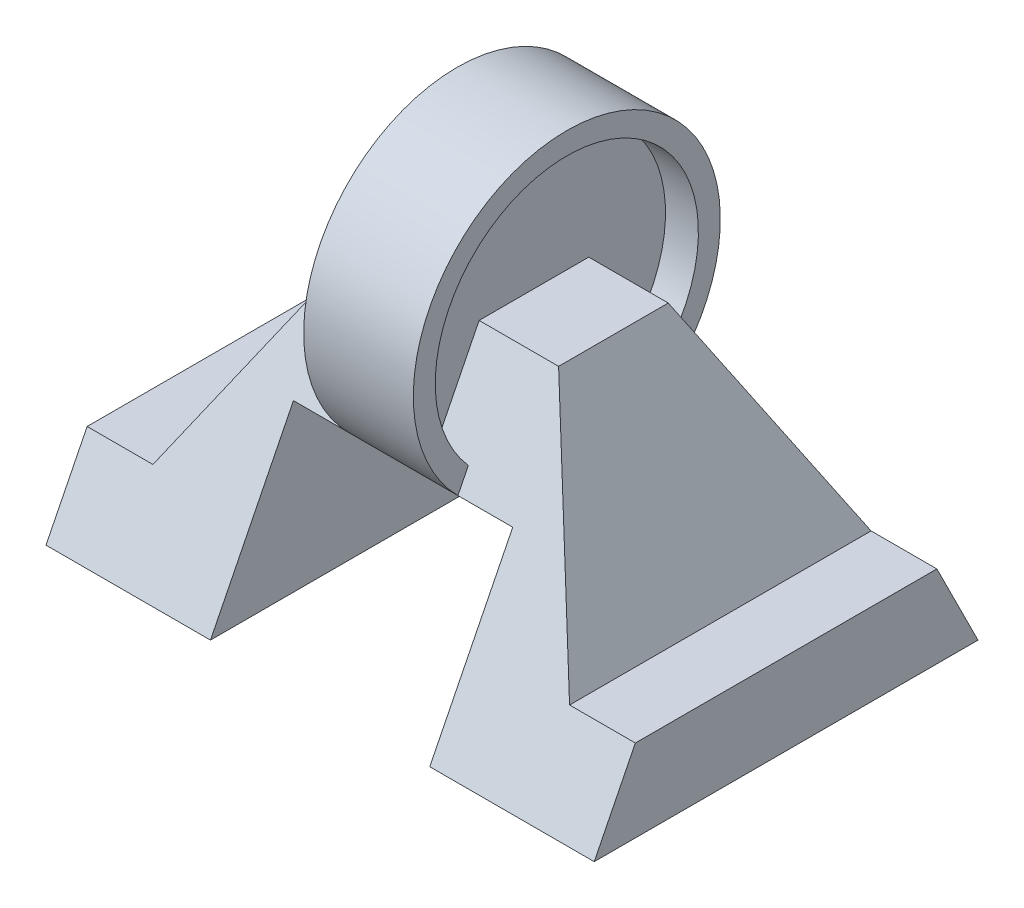
ISO-10303-21;
HEADER;
FILE_DESCRIPTION(('STEP AP214'),'2;1');
FILE_NAME('part.step','',(''),(''),'','','');
FILE_SCHEMA(('AUTOMOTIVE_DESIGN { 1 0 10303 214 1 1 1 1 }'));
ENDSEC;
DATA;
#1=APPLICATION_CONTEXT('core data for automotive mechanical design processes');
#2=APPLICATION_PROTOCOL_DEFINITION('international standard','automotive_design',2000,#1);
#3=PRODUCT_CONTEXT('',#1,'mechanical');
#4=PRODUCT('Part','Part','',(#3));
#5=PRODUCT_RELATED_PRODUCT_CATEGORY('part','',(#4));
#6=PRODUCT_DEFINITION_FORMATION('','',#4);
#7=PRODUCT_DEFINITION_CONTEXT('part definition',#1,'design');
#8=PRODUCT_DEFINITION('design','',#6,#7);
#9=PRODUCT_DEFINITION_SHAPE('','',#8);
#10=(LENGTH_UNIT() NAMED_UNIT(*) SI_UNIT(.MILLI.,.METRE.));
#11=(NAMED_UNIT(*) PLANE_ANGLE_UNIT() SI_UNIT($,.RADIAN.));
#12=(NAMED_UNIT(*) SI_UNIT($,.STERADIAN.) SOLID_ANGLE_UNIT());
#13=UNCERTAINTY_MEASURE_WITH_UNIT(LENGTH_MEASURE(1.E-05),#10,'distance_accuracy_value','');
#14=(GEOMETRIC_REPRESENTATION_CONTEXT(3) GLOBAL_UNCERTAINTY_ASSIGNED_CONTEXT((#13)) GLOBAL_UNIT_ASSIGNED_CONTEXT((#10,
#11,#12)) REPRESENTATION_CONTEXT('',''));
#15=CARTESIAN_POINT('',(0.,0.,0.));
#16=DIRECTION('',(0.,0.,1.));
#17=DIRECTION('',(1.,0.,0.));
#18=AXIS2_PLACEMENT_3D('',#15,#16,#17);
#19=CARTESIAN_POINT('',(50.,14.,-28.));
#20=DIRECTION('',(0.,-0.447213595499958,0.894427190999916));
#21=DIRECTION('',(0.,-0.894427190999916,-0.447213595499958));
#22=AXIS2_PLACEMENT_3D('',#19,#20,#21);
#23=PLANE('',#22);
#24=DIRECTION('',(0.,0.894427190999916,0.447213595499958));
#25=VECTOR('',#24,1.);
#26=CARTESIAN_POINT('',(-20.,14.,-28.));
#27=LINE('',#26,#25);
#28=CARTESIAN_POINT('',(-20.,0.,-35.));
#29=VERTEX_POINT('',#28);
#30=CARTESIAN_POINT('',(-20.,30.2681648412939,-19.8659175793531));
#31=VERTEX_POINT('',#30);
#32=EDGE_CURVE('E359',#29,#31,#27,.T.);
#33=ORIENTED_EDGE('',*,*,#32,.F.);
#34=DIRECTION('',(-1.,0.,0.));
#35=VECTOR('',#34,1.);
#36=CARTESIAN_POINT('',(50.,0.,-35.));
#37=LINE('',#36,#35);
#38=CARTESIAN_POINT('',(-50.,0.,-35.));
#39=VERTEX_POINT('',#38);
#40=EDGE_CURVE('E422',#29,#39,#37,.T.);
#41=ORIENTED_EDGE('',*,*,#40,.T.);
#42=DIRECTION('',(0.,0.894427190999916,0.447213595499958));
#43=VECTOR('',#42,1.);
#44=CARTESIAN_POINT('',(-50.,14.,-28.));
#45=LINE('',#44,#43);
#46=CARTESIAN_POINT('',(-50.,15.,-27.5));
#47=VERTEX_POINT('',#46);
#48=EDGE_CURVE('E414',#39,#47,#45,.T.);
#49=ORIENTED_EDGE('',*,*,#48,.T.);
#50=DIRECTION('',(1.,0.,0.));
#51=VECTOR('',#50,1.);
#52=CARTESIAN_POINT('',(50.,15.,-27.5));
#53=LINE('',#52,#51);
#54=CARTESIAN_POINT('',(-38.,15.,-27.5));
#55=VERTEX_POINT('',#54);
#56=EDGE_CURVE('E154',#47,#55,#53,.T.);
#57=ORIENTED_EDGE('',*,*,#56,.T.);
#58=DIRECTION('',(0.446012941307491,0.800536048500624,0.400268024250312));
#59=VECTOR('',#58,1.);
#60=CARTESIAN_POINT('',(-20.9406879414073,45.6192780538844,-12.1903609730578));
#61=LINE('',#60,#59);
#62=CARTESIAN_POINT('',(-18.5,50.,-10.));
#63=VERTEX_POINT('',#62);
#64=EDGE_CURVE('E361',#55,#63,#61,.T.);
#65=ORIENTED_EDGE('',*,*,#64,.T.);
#66=DIRECTION('',(-1.,0.,0.));
#67=VECTOR('',#66,1.);
#68=CARTESIAN_POINT('',(50.,50.,-10.));
#69=LINE('',#68,#67);
#70=CARTESIAN_POINT('',(-4.,50.,-10.));
#71=VERTEX_POINT('',#70);
#72=EDGE_CURVE('E306',#71,#63,#69,.T.);
#73=ORIENTED_EDGE('',*,*,#72,.F.);
#74=DIRECTION('',(0.,0.894427190999916,0.447213595499958));
#75=VECTOR('',#74,1.);
#76=CARTESIAN_POINT('',(-4.,14.,-28.));
#77=LINE('',#76,#75);
#78=CARTESIAN_POINT('',(-4.,34.080160643218,-17.959919678391));
#79=VERTEX_POINT('',#78);
#80=EDGE_CURVE('E370',#79,#71,#77,.T.);
#81=ORIENTED_EDGE('',*,*,#80,.F.);
#82=DIRECTION('',(-1.,0.,0.));
#83=VECTOR('',#82,1.);
#84=CARTESIAN_POINT('',(10.,34.080160643218,-17.959919678391));
#85=LINE('',#84,#83);
#86=CARTESIAN_POINT('',(-10.,34.080160643218,-17.959919678391));
#87=VERTEX_POINT('',#86);
#88=EDGE_CURVE('E412',#87,#79,#85,.F.);
#89=ORIENTED_EDGE('',*,*,#88,.F.);
#90=DIRECTION('',(0.,0.894427190999916,0.447213595499958));
#91=VECTOR('',#90,1.);
#92=CARTESIAN_POINT('',(-10.,14.,-28.));
#93=LINE('',#92,#91);
#94=CARTESIAN_POINT('',(-10.,30.2681648412939,-19.8659175793531));
#95=VERTEX_POINT('',#94);
#96=EDGE_CURVE('E405',#95,#87,#93,.T.);
#97=ORIENTED_EDGE('',*,*,#96,.F.);
#98=DIRECTION('',(1.,0.,0.));
#99=VECTOR('',#98,1.);
#100=CARTESIAN_POINT('',(50.,30.2681648412939,-19.8659175793531));
#101=LINE('',#100,#99);
#102=EDGE_CURVE('E346',#31,#95,#101,.T.);
#103=ORIENTED_EDGE('',*,*,#102,.F.);
#104=EDGE_LOOP('',(#33,#41,#49,#57,#65,#73,#81,#89,#97,#103));
#105=FACE_BOUND('',#104,.T.);
#106=ADVANCED_FACE('F132',(#105),#23,.F.);
#107=CARTESIAN_POINT('',(10.,30.2681648412939,-19.8659175793531));
#108=VERTEX_POINT('',#107);
#109=CARTESIAN_POINT('',(20.,30.2681648412939,-19.8659175793531));
#110=VERTEX_POINT('',#109);
#111=EDGE_CURVE('E342',#108,#110,#101,.T.);
#112=ORIENTED_EDGE('',*,*,#111,.F.);
#113=DIRECTION('',(0.,0.894427190999916,0.447213595499958));
#114=VECTOR('',#113,1.);
#115=CARTESIAN_POINT('',(10.,14.,-28.));
#116=LINE('',#115,#114);
#117=CARTESIAN_POINT('',(10.,34.080160643218,-17.959919678391));
#118=VERTEX_POINT('',#117);
#119=EDGE_CURVE('E408',#108,#118,#116,.T.);
#120=ORIENTED_EDGE('',*,*,#119,.T.);
#121=CARTESIAN_POINT('',(4.,34.080160643218,-17.959919678391));
#122=VERTEX_POINT('',#121);
#123=EDGE_CURVE('E411',#122,#118,#85,.F.);
#124=ORIENTED_EDGE('',*,*,#123,.F.);
#125=DIRECTION('',(0.,0.894427190999916,0.447213595499958));
#126=VECTOR('',#125,1.);
#127=CARTESIAN_POINT('',(4.,14.,-28.));
#128=LINE('',#127,#126);
#129=CARTESIAN_POINT('',(4.,50.,-10.));
#130=VERTEX_POINT('',#129);
#131=EDGE_CURVE('E376',#122,#130,#128,.T.);
#132=ORIENTED_EDGE('',*,*,#131,.T.);
#133=CARTESIAN_POINT('',(18.5,50.,-10.));
#134=VERTEX_POINT('',#133);
#135=EDGE_CURVE('E307',#134,#130,#69,.T.);
#136=ORIENTED_EDGE('',*,*,#135,.F.);
#137=DIRECTION('',(-0.446012941307491,0.800536048500624,0.400268024250312));
#138=VECTOR('',#137,1.);
#139=CARTESIAN_POINT('',(40.8334423227832,9.91433429244049,-30.0428328537798));
#140=LINE('',#139,#138);
#141=CARTESIAN_POINT('',(38.,15.,-27.5));
#142=VERTEX_POINT('',#141);
#143=EDGE_CURVE('E363',#142,#134,#140,.T.);
#144=ORIENTED_EDGE('',*,*,#143,.F.);
#145=DIRECTION('',(-1.,0.,0.));
#146=VECTOR('',#145,1.);
#147=CARTESIAN_POINT('',(50.,15.,-27.5));
#148=LINE('',#147,#146);
#149=CARTESIAN_POINT('',(50.,15.,-27.5));
#150=VERTEX_POINT('',#149);
#151=EDGE_CURVE('E292',#150,#142,#148,.T.);
#152=ORIENTED_EDGE('',*,*,#151,.F.);
#153=DIRECTION('',(0.,0.894427190999916,0.447213595499958));
#154=VECTOR('',#153,1.);
#155=CARTESIAN_POINT('',(50.,14.,-28.));
#156=LINE('',#155,#154);
#157=CARTESIAN_POINT('',(50.,0.,-35.));
#158=VERTEX_POINT('',#157);
#159=EDGE_CURVE('E415',#158,#150,#156,.T.);
#160=ORIENTED_EDGE('',*,*,#159,.F.);
#161=CARTESIAN_POINT('',(20.,0.,-35.));
#162=VERTEX_POINT('',#161);
#163=EDGE_CURVE('E302',#158,#162,#37,.T.);
#164=ORIENTED_EDGE('',*,*,#163,.T.);
#165=DIRECTION('',(0.,0.894427190999916,0.447213595499958));
#166=VECTOR('',#165,1.);
#167=CARTESIAN_POINT('',(20.,14.,-28.));
#168=LINE('',#167,#166);
#169=EDGE_CURVE('E275',#162,#110,#168,.T.);
#170=ORIENTED_EDGE('',*,*,#169,.T.);
#171=EDGE_LOOP('',(#112,#120,#124,#132,#136,#144,#152,#160,#164,#170));
#172=FACE_BOUND('',#171,.T.);
#173=ADVANCED_FACE('F442',(#172),#23,.F.);
#174=CARTESIAN_POINT('',(50.,50.,0.));
#175=DIRECTION('',(0.,-1.,0.));
#176=DIRECTION('',(0.,0.,-1.));
#177=AXIS2_PLACEMENT_3D('',#174,#175,#176);
#178=PLANE('',#177);
#179=DIRECTION('',(0.,0.,1.));
#180=VECTOR('',#179,1.);
#181=CARTESIAN_POINT('',(18.5,50.,-35.));
#182=LINE('',#181,#180);
#183=CARTESIAN_POINT('',(18.5,50.,9.99999999999999));
#184=VERTEX_POINT('',#183);
#185=EDGE_CURVE('E455',#134,#184,#182,.T.);
#186=ORIENTED_EDGE('',*,*,#185,.F.);
#187=ORIENTED_EDGE('',*,*,#135,.T.);
#188=DIRECTION('',(0.,0.,1.));
#189=VECTOR('',#188,1.);
#190=CARTESIAN_POINT('',(4.,50.,0.));
#191=LINE('',#190,#189);
#192=CARTESIAN_POINT('',(4.,50.,10.));
#193=VERTEX_POINT('',#192);
#194=EDGE_CURVE('E373',#130,#193,#191,.T.);
#195=ORIENTED_EDGE('',*,*,#194,.T.);
#196=DIRECTION('',(-1.,0.,0.));
#197=VECTOR('',#196,1.);
#198=CARTESIAN_POINT('',(50.,50.,10.));
#199=LINE('',#198,#197);
#200=EDGE_CURVE('E300',#184,#193,#199,.T.);
#201=ORIENTED_EDGE('',*,*,#200,.F.);
#202=EDGE_LOOP('',(#186,#187,#195,#201));
#203=FACE_BOUND('',#202,.T.);
#204=ADVANCED_FACE('F454',(#203),#178,.F.);
#205=CARTESIAN_POINT('',(50.,14.,28.));
#206=DIRECTION('',(0.,-0.447213595499958,-0.894427190999916));
#207=DIRECTION('',(0.,0.894427190999916,-0.447213595499958));
#208=AXIS2_PLACEMENT_3D('',#205,#206,#207);
#209=PLANE('',#208);
#210=DIRECTION('',(0.,-0.894427190999916,0.447213595499958));
#211=VECTOR('',#210,1.);
#212=CARTESIAN_POINT('',(-20.,14.,28.));
#213=LINE('',#212,#211);
#214=CARTESIAN_POINT('',(-20.,30.2681648412939,19.865917579353));
#215=VERTEX_POINT('',#214);
#216=CARTESIAN_POINT('',(-20.,0.,35.));
#217=VERTEX_POINT('',#216);
#218=EDGE_CURVE('E357',#215,#217,#213,.T.);
#219=ORIENTED_EDGE('',*,*,#218,.F.);
#220=DIRECTION('',(-1.,0.,0.));
#221=VECTOR('',#220,1.);
#222=CARTESIAN_POINT('',(50.,30.2681648412939,19.8659175793531));
#223=LINE('',#222,#221);
#224=CARTESIAN_POINT('',(-10.,30.2681648412939,19.8659175793531));
#225=VERTEX_POINT('',#224);
#226=EDGE_CURVE('E344',#225,#215,#223,.T.);
#227=ORIENTED_EDGE('',*,*,#226,.F.);
#228=DIRECTION('',(0.,-0.894427190999916,0.447213595499958));
#229=VECTOR('',#228,1.);
#230=CARTESIAN_POINT('',(-10.,14.,28.));
#231=LINE('',#230,#229);
#232=CARTESIAN_POINT('',(-10.,34.080160643218,17.959919678391));
#233=VERTEX_POINT('',#232);
#234=EDGE_CURVE('E309',#233,#225,#231,.T.);
#235=ORIENTED_EDGE('',*,*,#234,.F.);
#236=DIRECTION('',(-1.,0.,0.));
#237=VECTOR('',#236,1.);
#238=CARTESIAN_POINT('',(10.,34.080160643218,17.959919678391));
#239=LINE('',#238,#237);
#240=CARTESIAN_POINT('',(-4.,34.080160643218,17.959919678391));
#241=VERTEX_POINT('',#240);
#242=EDGE_CURVE('E312',#241,#233,#239,.T.);
#243=ORIENTED_EDGE('',*,*,#242,.F.);
#244=DIRECTION('',(0.,-0.894427190999916,0.447213595499958));
#245=VECTOR('',#244,1.);
#246=CARTESIAN_POINT('',(-4.,14.,28.));
#247=LINE('',#246,#245);
#248=CARTESIAN_POINT('',(-4.,50.,10.));
#249=VERTEX_POINT('',#248);
#250=EDGE_CURVE('E382',#249,#241,#247,.T.);
#251=ORIENTED_EDGE('',*,*,#250,.F.);
#252=CARTESIAN_POINT('',(-18.5,50.,10.));
#253=VERTEX_POINT('',#252);
#254=EDGE_CURVE('E296',#249,#253,#199,.T.);
#255=ORIENTED_EDGE('',*,*,#254,.T.);
#256=DIRECTION('',(-0.446012941307491,-0.800536048500624,0.400268024250312));
#257=VECTOR('',#256,1.);
#258=CARTESIAN_POINT('',(-20.9406879414073,45.6192780538844,12.1903609730578));
#259=LINE('',#258,#257);
#260=CARTESIAN_POINT('',(-38.,15.,27.5));
#261=VERTEX_POINT('',#260);
#262=EDGE_CURVE('E139',#253,#261,#259,.T.);
#263=ORIENTED_EDGE('',*,*,#262,.T.);
#264=DIRECTION('',(-1.,0.,0.));
#265=VECTOR('',#264,1.);
#266=CARTESIAN_POINT('',(50.,15.,27.5));
#267=LINE('',#266,#265);
#268=CARTESIAN_POINT('',(-50.,15.,27.5));
#269=VERTEX_POINT('',#268);
#270=EDGE_CURVE('E327',#261,#269,#267,.T.);
#271=ORIENTED_EDGE('',*,*,#270,.T.);
#272=DIRECTION('',(0.,-0.894427190999916,0.447213595499958));
#273=VECTOR('',#272,1.);
#274=CARTESIAN_POINT('',(-50.,14.,28.));
#275=LINE('',#274,#273);
#276=CARTESIAN_POINT('',(-50.,0.,35.));
#277=VERTEX_POINT('',#276);
#278=EDGE_CURVE('E425',#269,#277,#275,.T.);
#279=ORIENTED_EDGE('',*,*,#278,.T.);
#280=DIRECTION('',(-1.,0.,0.));
#281=VECTOR('',#280,1.);
#282=CARTESIAN_POINT('',(50.,0.,35.));
#283=LINE('',#282,#281);
#284=EDGE_CURVE('E297',#217,#277,#283,.T.);
#285=ORIENTED_EDGE('',*,*,#284,.F.);
#286=EDGE_LOOP('',(#219,#227,#235,#243,#251,#255,#263,#271,#279,#285));
#287=FACE_BOUND('',#286,.T.);
#288=ADVANCED_FACE('F325',(#287),#209,.F.);
#289=CARTESIAN_POINT('',(20.,30.2681648412939,19.865917579353));
#290=VERTEX_POINT('',#289);
#291=CARTESIAN_POINT('',(10.,30.2681648412939,19.8659175793531));
#292=VERTEX_POINT('',#291);
#293=EDGE_CURVE('E291',#290,#292,#223,.T.);
#294=ORIENTED_EDGE('',*,*,#293,.F.);
#295=DIRECTION('',(0.,-0.894427190999916,0.447213595499958));
#296=VECTOR('',#295,1.);
#297=CARTESIAN_POINT('',(20.,14.,28.));
#298=LINE('',#297,#296);
#299=CARTESIAN_POINT('',(20.,0.,35.));
#300=VERTEX_POINT('',#299);
#301=EDGE_CURVE('E272',#290,#300,#298,.T.);
#302=ORIENTED_EDGE('',*,*,#301,.T.);
#303=CARTESIAN_POINT('',(50.,0.,35.));
#304=VERTEX_POINT('',#303);
#305=EDGE_CURVE('E288',#304,#300,#283,.T.);
#306=ORIENTED_EDGE('',*,*,#305,.F.);
#307=DIRECTION('',(0.,-0.894427190999916,0.447213595499958));
#308=VECTOR('',#307,1.);
#309=CARTESIAN_POINT('',(50.,14.,28.));
#310=LINE('',#309,#308);
#311=CARTESIAN_POINT('',(50.,15.,27.5));
#312=VERTEX_POINT('',#311);
#313=EDGE_CURVE('E418',#312,#304,#310,.T.);
#314=ORIENTED_EDGE('',*,*,#313,.F.);
#315=DIRECTION('',(1.,0.,0.));
#316=VECTOR('',#315,1.);
#317=CARTESIAN_POINT('',(50.,15.,27.5));
#318=LINE('',#317,#316);
#319=CARTESIAN_POINT('',(38.,15.,27.5));
#320=VERTEX_POINT('',#319);
#321=EDGE_CURVE('E146',#320,#312,#318,.T.);
#322=ORIENTED_EDGE('',*,*,#321,.F.);
#323=DIRECTION('',(0.446012941307491,-0.800536048500624,0.400268024250312));
#324=VECTOR('',#323,1.);
#325=CARTESIAN_POINT('',(40.8334423227832,9.91433429244049,30.0428328537797));
#326=LINE('',#325,#324);
#327=EDGE_CURVE('E12',#184,#320,#326,.T.);
#328=ORIENTED_EDGE('',*,*,#327,.F.);
#329=ORIENTED_EDGE('',*,*,#200,.T.);
#330=DIRECTION('',(0.,-0.894427190999916,0.447213595499958));
#331=VECTOR('',#330,1.);
#332=CARTESIAN_POINT('',(4.,14.,28.));
#333=LINE('',#332,#331);
#334=CARTESIAN_POINT('',(4.,34.080160643218,17.959919678391));
#335=VERTEX_POINT('',#334);
#336=EDGE_CURVE('E369',#193,#335,#333,.T.);
#337=ORIENTED_EDGE('',*,*,#336,.T.);
#338=CARTESIAN_POINT('',(10.,34.080160643218,17.959919678391));
#339=VERTEX_POINT('',#338);
#340=EDGE_CURVE('E313',#339,#335,#239,.T.);
#341=ORIENTED_EDGE('',*,*,#340,.F.);
#342=DIRECTION('',(0.,-0.894427190999916,0.447213595499958));
#343=VECTOR('',#342,1.);
#344=CARTESIAN_POINT('',(10.,14.,28.));
#345=LINE('',#344,#343);
#346=EDGE_CURVE('E316',#339,#292,#345,.T.);
#347=ORIENTED_EDGE('',*,*,#346,.T.);
#348=EDGE_LOOP('',(#294,#302,#306,#314,#322,#328,#329,#337,#341,#347));
#349=FACE_BOUND('',#348,.T.);
#350=ADVANCED_FACE('F286',(#349),#209,.F.);
#351=CARTESIAN_POINT('',(50.,0.,0.));
#352=DIRECTION('',(0.,1.,0.));
#353=DIRECTION('',(0.,0.,1.));
#354=AXIS2_PLACEMENT_3D('',#351,#352,#353);
#355=PLANE('',#354);
#356=DIRECTION('',(0.,0.,1.));
#357=VECTOR('',#356,1.);
#358=CARTESIAN_POINT('',(-20.,0.,-35.));
#359=LINE('',#358,#357);
#360=EDGE_CURVE('E347',#29,#217,#359,.T.);
#361=ORIENTED_EDGE('',*,*,#360,.T.);
#362=ORIENTED_EDGE('',*,*,#284,.T.);
#363=DIRECTION('',(0.,0.,-1.));
#364=VECTOR('',#363,1.);
#365=CARTESIAN_POINT('',(-50.,0.,0.));
#366=LINE('',#365,#364);
#367=EDGE_CURVE('E419',#277,#39,#366,.T.);
#368=ORIENTED_EDGE('',*,*,#367,.T.);
#369=ORIENTED_EDGE('',*,*,#40,.F.);
#370=EDGE_LOOP('',(#361,#362,#368,#369));
#371=FACE_BOUND('',#370,.T.);
#372=ADVANCED_FACE('F432',(#371),#355,.F.);
#373=CARTESIAN_POINT('',(50.,0.,0.));
#374=DIRECTION('',(1.,0.,0.));
#375=DIRECTION('',(0.,0.,-1.));
#376=AXIS2_PLACEMENT_3D('',#373,#374,#375);
#377=PLANE('',#376);
#378=ORIENTED_EDGE('',*,*,#159,.T.);
#379=DIRECTION('',(0.,0.,1.));
#380=VECTOR('',#379,1.);
#381=CARTESIAN_POINT('',(50.,15.,0.));
#382=LINE('',#381,#380);
#383=EDGE_CURVE('E320',#150,#312,#382,.T.);
#384=ORIENTED_EDGE('',*,*,#383,.T.);
#385=ORIENTED_EDGE('',*,*,#313,.T.);
#386=DIRECTION('',(0.,0.,-1.));
#387=VECTOR('',#386,1.);
#388=CARTESIAN_POINT('',(50.,0.,0.));
#389=LINE('',#388,#387);
#390=EDGE_CURVE('E295',#304,#158,#389,.T.);
#391=ORIENTED_EDGE('',*,*,#390,.T.);
#392=EDGE_LOOP('',(#378,#384,#385,#391));
#393=FACE_BOUND('',#392,.T.);
#394=ADVANCED_FACE('F446',(#393),#377,.T.);
#395=ORIENTED_EDGE('',*,*,#72,.T.);
#396=DIRECTION('',(0.,0.,1.));
#397=VECTOR('',#396,1.);
#398=CARTESIAN_POINT('',(-18.5,50.,-35.));
#399=LINE('',#398,#397);
#400=EDGE_CURVE('E334',#63,#253,#399,.T.);
#401=ORIENTED_EDGE('',*,*,#400,.T.);
#402=ORIENTED_EDGE('',*,*,#254,.F.);
#403=DIRECTION('',(0.,0.,1.));
#404=VECTOR('',#403,1.);
#405=CARTESIAN_POINT('',(-4.,50.,0.));
#406=LINE('',#405,#404);
#407=EDGE_CURVE('E385',#71,#249,#406,.T.);
#408=ORIENTED_EDGE('',*,*,#407,.F.);
#409=EDGE_LOOP('',(#395,#401,#402,#408));
#410=FACE_BOUND('',#409,.T.);
#411=ADVANCED_FACE('F339',(#410),#178,.F.);
#412=CARTESIAN_POINT('',(10.,50.,0.));
#413=DIRECTION('',(-1.,0.,0.));
#414=DIRECTION('',(0.,0.,1.));
#415=AXIS2_PLACEMENT_3D('',#412,#413,#414);
#416=CYLINDRICAL_SURFACE('',#415,24.);
#417=CARTESIAN_POINT('',(-4.,50.,0.));
#418=DIRECTION('',(1.,0.,0.));
#419=DIRECTION('',(0.,0.,-1.));
#420=AXIS2_PLACEMENT_3D('',#417,#418,#419);
#421=CIRCLE('',#420,24.);
#422=EDGE_CURVE('E365',#241,#79,#421,.F.);
#423=ORIENTED_EDGE('',*,*,#422,.F.);
#424=ORIENTED_EDGE('',*,*,#242,.T.);
#425=CARTESIAN_POINT('',(-10.,50.,0.));
#426=DIRECTION('',(1.,0.,0.));
#427=DIRECTION('',(0.,0.,-1.));
#428=AXIS2_PLACEMENT_3D('',#425,#426,#427);
#429=CIRCLE('',#428,24.);
#430=EDGE_CURVE('E393',#233,#87,#429,.F.);
#431=ORIENTED_EDGE('',*,*,#430,.T.);
#432=ORIENTED_EDGE('',*,*,#88,.T.);
#433=EDGE_LOOP('',(#423,#424,#431,#432));
#434=FACE_BOUND('',#433,.T.);
#435=ADVANCED_FACE('F485',(#434),#416,.F.);
#436=ORIENTED_EDGE('',*,*,#305,.T.);
#437=DIRECTION('',(0.,0.,1.));
#438=VECTOR('',#437,1.);
#439=CARTESIAN_POINT('',(20.,0.,-35.));
#440=LINE('',#439,#438);
#441=EDGE_CURVE('E268',#162,#300,#440,.T.);
#442=ORIENTED_EDGE('',*,*,#441,.F.);
#443=ORIENTED_EDGE('',*,*,#163,.F.);
#444=ORIENTED_EDGE('',*,*,#390,.F.);
#445=EDGE_LOOP('',(#436,#442,#443,#444));
#446=FACE_BOUND('',#445,.T.);
#447=ADVANCED_FACE('F294',(#446),#355,.F.);
#448=CARTESIAN_POINT('',(-50.,0.,0.));
#449=DIRECTION('',(1.,0.,0.));
#450=DIRECTION('',(0.,0.,-1.));
#451=AXIS2_PLACEMENT_3D('',#448,#449,#450);
#452=PLANE('',#451);
#453=ORIENTED_EDGE('',*,*,#278,.F.);
#454=DIRECTION('',(0.,0.,-1.));
#455=VECTOR('',#454,1.);
#456=CARTESIAN_POINT('',(-50.,15.,0.));
#457=LINE('',#456,#455);
#458=EDGE_CURVE('E318',#269,#47,#457,.T.);
#459=ORIENTED_EDGE('',*,*,#458,.T.);
#460=ORIENTED_EDGE('',*,*,#48,.F.);
#461=ORIENTED_EDGE('',*,*,#367,.F.);
#462=EDGE_LOOP('',(#453,#459,#460,#461));
#463=FACE_BOUND('',#462,.T.);
#464=ADVANCED_FACE('F435',(#463),#452,.F.);
#465=ORIENTED_EDGE('',*,*,#340,.T.);
#466=CARTESIAN_POINT('',(4.,50.,0.));
#467=DIRECTION('',(1.,0.,0.));
#468=DIRECTION('',(0.,0.,-1.));
#469=AXIS2_PLACEMENT_3D('',#466,#467,#468);
#470=CIRCLE('',#469,24.);
#471=EDGE_CURVE('E366',#335,#122,#470,.F.);
#472=ORIENTED_EDGE('',*,*,#471,.T.);
#473=ORIENTED_EDGE('',*,*,#123,.T.);
#474=CARTESIAN_POINT('',(10.,50.,0.));
#475=DIRECTION('',(1.,0.,0.));
#476=DIRECTION('',(0.,0.,-1.));
#477=AXIS2_PLACEMENT_3D('',#474,#475,#476);
#478=CIRCLE('',#477,24.);
#479=EDGE_CURVE('E392',#339,#118,#478,.F.);
#480=ORIENTED_EDGE('',*,*,#479,.F.);
#481=EDGE_LOOP('',(#465,#472,#473,#480));
#482=FACE_BOUND('',#481,.T.);
#483=ADVANCED_FACE('F464',(#482),#416,.F.);
#484=CARTESIAN_POINT('',(10.,0.,0.));
#485=DIRECTION('',(1.,0.,0.));
#486=DIRECTION('',(0.,0.,-1.));
#487=AXIS2_PLACEMENT_3D('',#484,#485,#486);
#488=PLANE('',#487);
#489=ORIENTED_EDGE('',*,*,#119,.F.);
#490=CARTESIAN_POINT('',(10.,50.,0.));
#491=DIRECTION('',(1.,0.,0.));
#492=DIRECTION('',(0.,0.,-1.));
#493=AXIS2_PLACEMENT_3D('',#490,#491,#492);
#494=CIRCLE('',#493,28.);
#495=EDGE_CURVE('E389',#292,#108,#494,.F.);
#496=ORIENTED_EDGE('',*,*,#495,.F.);
#497=ORIENTED_EDGE('',*,*,#346,.F.);
#498=ORIENTED_EDGE('',*,*,#479,.T.);
#499=EDGE_LOOP('',(#489,#496,#497,#498));
#500=FACE_BOUND('',#499,.T.);
#501=ADVANCED_FACE('F469',(#500),#488,.T.);
#502=CARTESIAN_POINT('',(-10.,0.,0.));
#503=DIRECTION('',(1.,0.,0.));
#504=DIRECTION('',(0.,0.,-1.));
#505=AXIS2_PLACEMENT_3D('',#502,#503,#504);
#506=PLANE('',#505);
#507=CARTESIAN_POINT('',(-10.,50.,0.));
#508=DIRECTION('',(1.,0.,0.));
#509=DIRECTION('',(0.,0.,-1.));
#510=AXIS2_PLACEMENT_3D('',#507,#508,#509);
#511=CIRCLE('',#510,28.);
#512=EDGE_CURVE('E379',#225,#95,#511,.F.);
#513=ORIENTED_EDGE('',*,*,#512,.T.);
#514=ORIENTED_EDGE('',*,*,#96,.T.);
#515=ORIENTED_EDGE('',*,*,#430,.F.);
#516=ORIENTED_EDGE('',*,*,#234,.T.);
#517=EDGE_LOOP('',(#513,#514,#515,#516));
#518=FACE_BOUND('',#517,.T.);
#519=ADVANCED_FACE('F482',(#518),#506,.F.);
#520=CARTESIAN_POINT('',(10.,50.,0.));
#521=DIRECTION('',(-1.,0.,0.));
#522=DIRECTION('',(0.,0.,1.));
#523=AXIS2_PLACEMENT_3D('',#520,#521,#522);
#524=CYLINDRICAL_SURFACE('',#523,28.);
#525=ORIENTED_EDGE('',*,*,#512,.F.);
#526=DIRECTION('',(-1.,0.,0.));
#527=VECTOR('',#526,1.);
#528=CARTESIAN_POINT('',(10.,30.2681648412939,19.8659175793531));
#529=LINE('',#528,#527);
#530=EDGE_CURVE('E403',#292,#225,#529,.T.);
#531=ORIENTED_EDGE('',*,*,#530,.F.);
#532=ORIENTED_EDGE('',*,*,#495,.T.);
#533=DIRECTION('',(-1.,0.,0.));
#534=VECTOR('',#533,1.);
#535=CARTESIAN_POINT('',(10.,30.2681648412939,-19.8659175793531));
#536=LINE('',#535,#534);
#537=EDGE_CURVE('E396',#108,#95,#536,.T.);
#538=ORIENTED_EDGE('',*,*,#537,.T.);
#539=EDGE_LOOP('',(#525,#531,#532,#538));
#540=FACE_BOUND('',#539,.T.);
#541=ADVANCED_FACE('F472',(#540),#524,.T.);
#542=CARTESIAN_POINT('',(-4.,0.,0.));
#543=DIRECTION('',(1.,0.,0.));
#544=DIRECTION('',(0.,0.,-1.));
#545=AXIS2_PLACEMENT_3D('',#542,#543,#544);
#546=PLANE('',#545);
#547=ORIENTED_EDGE('',*,*,#422,.T.);
#548=ORIENTED_EDGE('',*,*,#80,.T.);
#549=ORIENTED_EDGE('',*,*,#407,.T.);
#550=ORIENTED_EDGE('',*,*,#250,.T.);
#551=EDGE_LOOP('',(#547,#548,#549,#550));
#552=FACE_BOUND('',#551,.T.);
#553=ADVANCED_FACE('F488',(#552),#546,.F.);
#554=CARTESIAN_POINT('',(4.,0.,0.));
#555=DIRECTION('',(1.,0.,0.));
#556=DIRECTION('',(0.,0.,-1.));
#557=AXIS2_PLACEMENT_3D('',#554,#555,#556);
#558=PLANE('',#557);
#559=ORIENTED_EDGE('',*,*,#471,.F.);
#560=ORIENTED_EDGE('',*,*,#336,.F.);
#561=ORIENTED_EDGE('',*,*,#194,.F.);
#562=ORIENTED_EDGE('',*,*,#131,.F.);
#563=EDGE_LOOP('',(#559,#560,#561,#562));
#564=FACE_BOUND('',#563,.T.);
#565=ADVANCED_FACE('F459',(#564),#558,.T.);
#566=CARTESIAN_POINT('',(-20.,0.,-35.));
#567=DIRECTION('',(1.,0.,0.));
#568=DIRECTION('',(0.,0.,-1.));
#569=AXIS2_PLACEMENT_3D('',#566,#567,#568);
#570=PLANE('',#569);
#571=ORIENTED_EDGE('',*,*,#32,.T.);
#572=DIRECTION('',(0.,0.,1.));
#573=VECTOR('',#572,1.);
#574=CARTESIAN_POINT('',(-20.,30.2681648412939,-35.));
#575=LINE('',#574,#573);
#576=EDGE_CURVE('E618',#31,#215,#575,.T.);
#577=ORIENTED_EDGE('',*,*,#576,.T.);
#578=ORIENTED_EDGE('',*,*,#218,.T.);
#579=ORIENTED_EDGE('',*,*,#360,.F.);
#580=EDGE_LOOP('',(#571,#577,#578,#579));
#581=FACE_BOUND('',#580,.T.);
#582=ADVANCED_FACE('F570',(#581),#570,.T.);
#583=CARTESIAN_POINT('',(20.,0.,-35.));
#584=DIRECTION('',(1.,0.,0.));
#585=DIRECTION('',(0.,0.,-1.));
#586=AXIS2_PLACEMENT_3D('',#583,#584,#585);
#587=PLANE('',#586);
#588=ORIENTED_EDGE('',*,*,#441,.T.);
#589=ORIENTED_EDGE('',*,*,#301,.F.);
#590=DIRECTION('',(0.,0.,1.));
#591=VECTOR('',#590,1.);
#592=CARTESIAN_POINT('',(20.,30.2681648412939,-35.));
#593=LINE('',#592,#591);
#594=EDGE_CURVE('E280',#110,#290,#593,.T.);
#595=ORIENTED_EDGE('',*,*,#594,.F.);
#596=ORIENTED_EDGE('',*,*,#169,.F.);
#597=EDGE_LOOP('',(#588,#589,#595,#596));
#598=FACE_BOUND('',#597,.T.);
#599=ADVANCED_FACE('F270',(#598),#587,.F.);
#600=CARTESIAN_POINT('',(0.,30.2681648412939,-35.));
#601=DIRECTION('',(0.,-1.,0.));
#602=DIRECTION('',(0.,0.,-1.));
#603=AXIS2_PLACEMENT_3D('',#600,#601,#602);
#604=PLANE('',#603);
#605=ORIENTED_EDGE('',*,*,#102,.T.);
#606=ORIENTED_EDGE('',*,*,#537,.F.);
#607=ORIENTED_EDGE('',*,*,#111,.T.);
#608=ORIENTED_EDGE('',*,*,#594,.T.);
#609=ORIENTED_EDGE('',*,*,#293,.T.);
#610=ORIENTED_EDGE('',*,*,#530,.T.);
#611=ORIENTED_EDGE('',*,*,#226,.T.);
#612=ORIENTED_EDGE('',*,*,#576,.F.);
#613=EDGE_LOOP('',(#605,#606,#607,#608,#609,#610,#611,#612));
#614=FACE_BOUND('',#613,.T.);
#615=ADVANCED_FACE('F475',(#614),#604,.T.);
#616=CARTESIAN_POINT('',(-35.376109640243,19.7095467995639,-35.));
#617=DIRECTION('',(0.873567976283815,-0.486702158215268,0.));
#618=DIRECTION('',(0.486702158215269,0.873567976283815,0.));
#619=AXIS2_PLACEMENT_3D('',#616,#617,#618);
#620=PLANE('',#619);
#621=DIRECTION('',(0.,0.,1.));
#622=VECTOR('',#621,1.);
#623=CARTESIAN_POINT('',(-38.,15.,-35.));
#624=LINE('',#623,#622);
#625=EDGE_CURVE('E336',#55,#261,#624,.T.);
#626=ORIENTED_EDGE('',*,*,#625,.T.);
#627=ORIENTED_EDGE('',*,*,#262,.F.);
#628=ORIENTED_EDGE('',*,*,#400,.F.);
#629=ORIENTED_EDGE('',*,*,#64,.F.);
#630=EDGE_LOOP('',(#626,#627,#628,#629));
#631=FACE_BOUND('',#630,.T.);
#632=ADVANCED_FACE('F333',(#631),#620,.F.);
#633=CARTESIAN_POINT('',(0.,15.,-35.));
#634=DIRECTION('',(0.,-1.,0.));
#635=DIRECTION('',(0.,0.,-1.));
#636=AXIS2_PLACEMENT_3D('',#633,#634,#635);
#637=PLANE('',#636);
#638=ORIENTED_EDGE('',*,*,#458,.F.);
#639=ORIENTED_EDGE('',*,*,#270,.F.);
#640=ORIENTED_EDGE('',*,*,#625,.F.);
#641=ORIENTED_EDGE('',*,*,#56,.F.);
#642=EDGE_LOOP('',(#638,#639,#640,#641));
#643=FACE_BOUND('',#642,.T.);
#644=ADVANCED_FACE('F489',(#643),#637,.F.);
#645=CARTESIAN_POINT('',(35.376109640243,19.7095467995639,-35.));
#646=DIRECTION('',(0.873567976283815,0.486702158215268,0.));
#647=DIRECTION('',(-0.486702158215269,0.873567976283815,0.));
#648=AXIS2_PLACEMENT_3D('',#645,#646,#647);
#649=PLANE('',#648);
#650=ORIENTED_EDGE('',*,*,#143,.T.);
#651=ORIENTED_EDGE('',*,*,#185,.T.);
#652=ORIENTED_EDGE('',*,*,#327,.T.);
#653=DIRECTION('',(0.,0.,1.));
#654=VECTOR('',#653,1.);
#655=CARTESIAN_POINT('',(38.,15.,-35.));
#656=LINE('',#655,#654);
#657=EDGE_CURVE('E281',#142,#320,#656,.T.);
#658=ORIENTED_EDGE('',*,*,#657,.F.);
#659=EDGE_LOOP('',(#650,#651,#652,#658));
#660=FACE_BOUND('',#659,.T.);
#661=ADVANCED_FACE('F491',(#660),#649,.T.);
#662=CARTESIAN_POINT('',(0.,15.,-35.));
#663=DIRECTION('',(0.,1.,0.));
#664=DIRECTION('',(0.,0.,1.));
#665=AXIS2_PLACEMENT_3D('',#662,#663,#664);
#666=PLANE('',#665);
#667=ORIENTED_EDGE('',*,*,#151,.T.);
#668=ORIENTED_EDGE('',*,*,#657,.T.);
#669=ORIENTED_EDGE('',*,*,#321,.T.);
#670=ORIENTED_EDGE('',*,*,#383,.F.);
#671=EDGE_LOOP('',(#667,#668,#669,#670));
#672=FACE_BOUND('',#671,.T.);
#673=ADVANCED_FACE('F497',(#672),#666,.T.);
#674=CLOSED_SHELL('',(#106,#173,#204,#288,#350,#372,#394,#411,#435,#447,#464,#483,#501,#519,
#541,#553,#565,#582,#599,#615,#632,#644,#661,#673));
#675=MANIFOLD_SOLID_BREP('B2',#674);
#676=ADVANCED_BREP_SHAPE_REPRESENTATION('',(#18,#675),#14);
#677=SHAPE_DEFINITION_REPRESENTATION(#9,#676);
ENDSEC;
END-ISO-10303-21;
